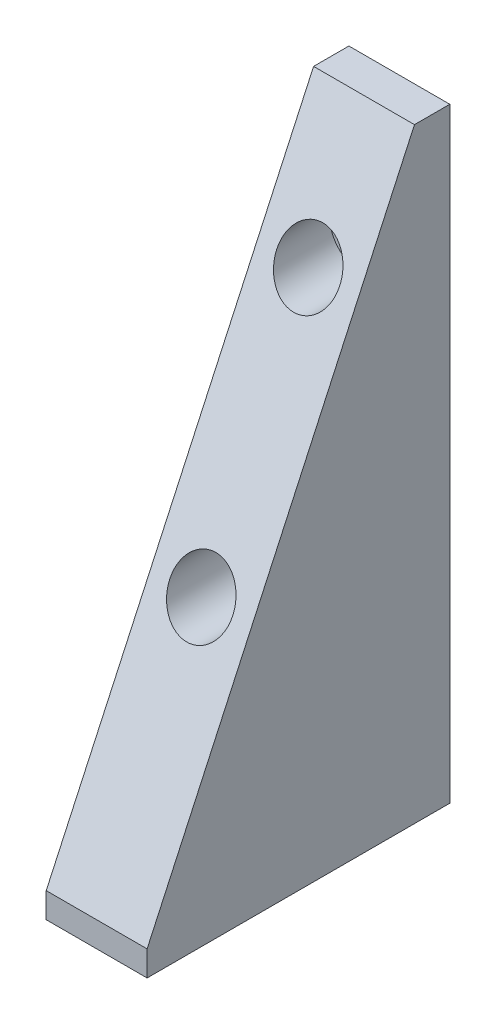
ISO-10303-21;
HEADER;
FILE_DESCRIPTION(('STEP AP214'),'2;1');
FILE_NAME('part.step','',(''),(''),'','','');
FILE_SCHEMA(('AUTOMOTIVE_DESIGN { 1 0 10303 214 1 1 1 1 }'));
ENDSEC;
DATA;
#1=APPLICATION_CONTEXT('core data for automotive mechanical design processes');
#2=APPLICATION_PROTOCOL_DEFINITION('international standard','automotive_design',2000,#1);
#3=PRODUCT_CONTEXT('',#1,'mechanical');
#4=PRODUCT('Part','Part','',(#3));
#5=PRODUCT_RELATED_PRODUCT_CATEGORY('part','',(#4));
#6=PRODUCT_DEFINITION_FORMATION('','',#4);
#7=PRODUCT_DEFINITION_CONTEXT('part definition',#1,'design');
#8=PRODUCT_DEFINITION('design','',#6,#7);
#9=PRODUCT_DEFINITION_SHAPE('','',#8);
#10=(LENGTH_UNIT() NAMED_UNIT(*) SI_UNIT(.MILLI.,.METRE.));
#11=(NAMED_UNIT(*) PLANE_ANGLE_UNIT() SI_UNIT($,.RADIAN.));
#12=(NAMED_UNIT(*) SI_UNIT($,.STERADIAN.) SOLID_ANGLE_UNIT());
#13=UNCERTAINTY_MEASURE_WITH_UNIT(LENGTH_MEASURE(1.E-05),#10,'distance_accuracy_value','');
#14=(GEOMETRIC_REPRESENTATION_CONTEXT(3) GLOBAL_UNCERTAINTY_ASSIGNED_CONTEXT((#13)) GLOBAL_UNIT_ASSIGNED_CONTEXT((#10,
#11,#12)) REPRESENTATION_CONTEXT('',''));
#15=CARTESIAN_POINT('',(0.,0.,0.));
#16=DIRECTION('',(0.,0.,1.));
#17=DIRECTION('',(1.,0.,0.));
#18=AXIS2_PLACEMENT_3D('',#15,#16,#17);
#19=CARTESIAN_POINT('',(25.4,-25.781,-30.4159761721431));
#20=DIRECTION('',(0.,0.,1.));
#21=DIRECTION('',(1.,0.,0.));
#22=AXIS2_PLACEMENT_3D('',#19,#20,#21);
#23=PLANE('',#22);
#24=CARTESIAN_POINT('',(12.7,37.719,-30.4159761721431));
#25=DIRECTION('',(0.,0.,1.));
#26=DIRECTION('',(1.,0.,0.));
#27=AXIS2_PLACEMENT_3D('',#24,#25,#26);
#28=CIRCLE('',#27,4.9022);
#29=CARTESIAN_POINT('',(17.6022,37.719,-30.4159761721431));
#30=VERTEX_POINT('',#29);
#31=EDGE_CURVE('E153',#30,#30,#28,.T.);
#32=ORIENTED_EDGE('',*,*,#31,.T.);
#33=EDGE_LOOP('',(#32));
#34=FACE_BOUND('',#33,.T.);
#35=CARTESIAN_POINT('',(12.7,96.139,-30.4159761721431));
#36=DIRECTION('',(0.,0.,1.));
#37=DIRECTION('',(1.,0.,0.));
#38=AXIS2_PLACEMENT_3D('',#35,#36,#37);
#39=CIRCLE('',#38,4.9022);
#40=CARTESIAN_POINT('',(17.6022,96.139,-30.4159761721431));
#41=VERTEX_POINT('',#40);
#42=EDGE_CURVE('E118',#41,#41,#39,.T.);
#43=ORIENTED_EDGE('',*,*,#42,.T.);
#44=EDGE_LOOP('',(#43));
#45=FACE_BOUND('',#44,.T.);
#46=DIRECTION('',(0.,1.,0.));
#47=VECTOR('',#46,1.);
#48=CARTESIAN_POINT('',(0.,-25.781,-30.4159761721431));
#49=LINE('',#48,#47);
#50=CARTESIAN_POINT('',(0.,-25.781,-30.4159761721431));
#51=VERTEX_POINT('',#50);
#52=CARTESIAN_POINT('',(0.,126.619,-30.4159761721431));
#53=VERTEX_POINT('',#52);
#54=EDGE_CURVE('E114',#51,#53,#49,.T.);
#55=ORIENTED_EDGE('',*,*,#54,.T.);
#56=DIRECTION('',(-1.,0.,0.));
#57=VECTOR('',#56,1.);
#58=CARTESIAN_POINT('',(25.4,126.619,-30.4159761721431));
#59=LINE('',#58,#57);
#60=CARTESIAN_POINT('',(25.4,126.619,-30.4159761721431));
#61=VERTEX_POINT('',#60);
#62=EDGE_CURVE('E11',#61,#53,#59,.T.);
#63=ORIENTED_EDGE('',*,*,#62,.F.);
#64=DIRECTION('',(0.,1.,0.));
#65=VECTOR('',#64,1.);
#66=CARTESIAN_POINT('',(25.4,-25.781,-30.4159761721431));
#67=LINE('',#66,#65);
#68=CARTESIAN_POINT('',(25.4,-25.781,-30.4159761721431));
#69=VERTEX_POINT('',#68);
#70=EDGE_CURVE('E123',#69,#61,#67,.T.);
#71=ORIENTED_EDGE('',*,*,#70,.F.);
#72=DIRECTION('',(-1.,0.,0.));
#73=VECTOR('',#72,1.);
#74=CARTESIAN_POINT('',(25.4,-25.781,-30.4159761721431));
#75=LINE('',#74,#73);
#76=EDGE_CURVE('E110',#69,#51,#75,.T.);
#77=ORIENTED_EDGE('',*,*,#76,.T.);
#78=EDGE_LOOP('',(#55,#63,#71,#77));
#79=FACE_BOUND('',#78,.T.);
#80=ADVANCED_FACE('F37',(#34,#45,#79),#23,.F.);
#81=CARTESIAN_POINT('',(25.4,126.619,-21.5259761721431));
#82=DIRECTION('',(0.,-1.,0.));
#83=DIRECTION('',(0.,0.,-1.));
#84=AXIS2_PLACEMENT_3D('',#81,#82,#83);
#85=PLANE('',#84);
#86=DIRECTION('',(0.,0.,1.));
#87=VECTOR('',#86,1.);
#88=CARTESIAN_POINT('',(0.,126.619,-21.5259761721431));
#89=LINE('',#88,#87);
#90=CARTESIAN_POINT('',(0.,126.619,-21.5259761721431));
#91=VERTEX_POINT('',#90);
#92=EDGE_CURVE('E117',#53,#91,#89,.T.);
#93=ORIENTED_EDGE('',*,*,#92,.T.);
#94=DIRECTION('',(-1.,0.,0.));
#95=VECTOR('',#94,1.);
#96=CARTESIAN_POINT('',(25.4,126.619,-21.5259761721431));
#97=LINE('',#96,#95);
#98=CARTESIAN_POINT('',(25.4,126.619,-21.5259761721431));
#99=VERTEX_POINT('',#98);
#100=EDGE_CURVE('E45',#99,#91,#97,.T.);
#101=ORIENTED_EDGE('',*,*,#100,.F.);
#102=DIRECTION('',(0.,0.,1.));
#103=VECTOR('',#102,1.);
#104=CARTESIAN_POINT('',(25.4,126.619,-21.5259761721431));
#105=LINE('',#104,#103);
#106=EDGE_CURVE('E88',#61,#99,#105,.T.);
#107=ORIENTED_EDGE('',*,*,#106,.F.);
#108=ORIENTED_EDGE('',*,*,#62,.T.);
#109=EDGE_LOOP('',(#93,#101,#107,#108));
#110=FACE_BOUND('',#109,.T.);
#111=ADVANCED_FACE('F145',(#110),#85,.F.);
#112=CARTESIAN_POINT('',(25.4,126.619,-21.5259761721431));
#113=DIRECTION('',(0.,-0.418557308836963,-0.90819038709907));
#114=DIRECTION('',(0.,0.90819038709907,-0.418557308836963));
#115=AXIS2_PLACEMENT_3D('',#112,#113,#114);
#116=PLANE('',#115);
#117=CARTESIAN_POINT('',(12.7,96.139,-7.47867182431704));
#118=DIRECTION('',(0.,-0.418557308836963,-0.90819038709907));
#119=DIRECTION('',(0.,0.90819038709907,-0.418557308836963));
#120=AXIS2_PLACEMENT_3D('',#117,#118,#119);
#121=ELLIPSE('',#120,8.739907526828,7.9375);
#122=CARTESIAN_POINT('',(12.7,104.0765,-11.1368239982301));
#123=VERTEX_POINT('',#122);
#124=EDGE_CURVE('E176',#123,#123,#121,.T.);
#125=ORIENTED_EDGE('',*,*,#124,.T.);
#126=EDGE_LOOP('',(#125));
#127=FACE_BOUND('',#126,.T.);
#128=CARTESIAN_POINT('',(12.7,37.719,19.445328175683));
#129=DIRECTION('',(0.,-0.418557308836963,-0.90819038709907));
#130=DIRECTION('',(0.,0.90819038709907,-0.418557308836963));
#131=AXIS2_PLACEMENT_3D('',#128,#129,#130);
#132=ELLIPSE('',#131,8.739907526828,7.9375);
#133=CARTESIAN_POINT('',(12.7,45.6565,15.7871760017699));
#134=VERTEX_POINT('',#133);
#135=EDGE_CURVE('E173',#134,#134,#132,.T.);
#136=ORIENTED_EDGE('',*,*,#135,.T.);
#137=EDGE_LOOP('',(#136));
#138=FACE_BOUND('',#137,.T.);
#139=DIRECTION('',(0.,-0.90819038709907,0.418557308836963));
#140=VECTOR('',#139,1.);
#141=CARTESIAN_POINT('',(0.,126.619,-21.5259761721431));
#142=LINE('',#141,#140);
#143=CARTESIAN_POINT('',(0.,-19.431,45.7840238278569));
#144=VERTEX_POINT('',#143);
#145=EDGE_CURVE('E105',#91,#144,#142,.T.);
#146=ORIENTED_EDGE('',*,*,#145,.T.);
#147=DIRECTION('',(-1.,0.,0.));
#148=VECTOR('',#147,1.);
#149=CARTESIAN_POINT('',(25.4,-19.431,45.7840238278569));
#150=LINE('',#149,#148);
#151=CARTESIAN_POINT('',(25.4,-19.431,45.7840238278569));
#152=VERTEX_POINT('',#151);
#153=EDGE_CURVE('E102',#152,#144,#150,.T.);
#154=ORIENTED_EDGE('',*,*,#153,.F.);
#155=DIRECTION('',(0.,-0.90819038709907,0.418557308836963));
#156=VECTOR('',#155,1.);
#157=CARTESIAN_POINT('',(25.4,126.619,-21.5259761721431));
#158=LINE('',#157,#156);
#159=EDGE_CURVE('E94',#99,#152,#158,.T.);
#160=ORIENTED_EDGE('',*,*,#159,.F.);
#161=ORIENTED_EDGE('',*,*,#100,.T.);
#162=EDGE_LOOP('',(#146,#154,#160,#161));
#163=FACE_BOUND('',#162,.T.);
#164=ADVANCED_FACE('F103',(#127,#138,#163),#116,.F.);
#165=CARTESIAN_POINT('',(25.4,-19.431,45.7840238278569));
#166=DIRECTION('',(0.,0.,-1.));
#167=DIRECTION('',(-1.,0.,0.));
#168=AXIS2_PLACEMENT_3D('',#165,#166,#167);
#169=PLANE('',#168);
#170=DIRECTION('',(0.,-1.,0.));
#171=VECTOR('',#170,1.);
#172=CARTESIAN_POINT('',(0.,-19.431,45.7840238278569));
#173=LINE('',#172,#171);
#174=CARTESIAN_POINT('',(0.,-25.781,45.7840238278569));
#175=VERTEX_POINT('',#174);
#176=EDGE_CURVE('E74',#144,#175,#173,.T.);
#177=ORIENTED_EDGE('',*,*,#176,.T.);
#178=DIRECTION('',(-1.,0.,0.));
#179=VECTOR('',#178,1.);
#180=CARTESIAN_POINT('',(25.4,-25.781,45.7840238278569));
#181=LINE('',#180,#179);
#182=CARTESIAN_POINT('',(25.4,-25.781,45.7840238278569));
#183=VERTEX_POINT('',#182);
#184=EDGE_CURVE('E106',#183,#175,#181,.T.);
#185=ORIENTED_EDGE('',*,*,#184,.F.);
#186=DIRECTION('',(0.,-1.,0.));
#187=VECTOR('',#186,1.);
#188=CARTESIAN_POINT('',(25.4,-19.431,45.7840238278569));
#189=LINE('',#188,#187);
#190=EDGE_CURVE('E98',#152,#183,#189,.T.);
#191=ORIENTED_EDGE('',*,*,#190,.F.);
#192=ORIENTED_EDGE('',*,*,#153,.T.);
#193=EDGE_LOOP('',(#177,#185,#191,#192));
#194=FACE_BOUND('',#193,.T.);
#195=ADVANCED_FACE('F108',(#194),#169,.F.);
#196=CARTESIAN_POINT('',(25.4,-25.781,45.7840238278569));
#197=DIRECTION('',(0.,1.,0.));
#198=DIRECTION('',(0.,0.,1.));
#199=AXIS2_PLACEMENT_3D('',#196,#197,#198);
#200=PLANE('',#199);
#201=CARTESIAN_POINT('',(12.7,-25.781,-15.1759761721431));
#202=DIRECTION('',(0.,-1.,0.));
#203=DIRECTION('',(0.,0.,-1.));
#204=AXIS2_PLACEMENT_3D('',#201,#202,#203);
#205=CIRCLE('',#204,3.96875);
#206=CARTESIAN_POINT('',(12.7,-25.781,-19.1447261721431));
#207=VERTEX_POINT('',#206);
#208=EDGE_CURVE('E188',#207,#207,#205,.T.);
#209=ORIENTED_EDGE('',*,*,#208,.F.);
#210=EDGE_LOOP('',(#209));
#211=FACE_BOUND('',#210,.T.);
#212=CARTESIAN_POINT('',(12.7,-25.781,25.4640238278569));
#213=DIRECTION('',(0.,-1.,0.));
#214=DIRECTION('',(0.,0.,-1.));
#215=AXIS2_PLACEMENT_3D('',#212,#213,#214);
#216=CIRCLE('',#215,3.96875);
#217=CARTESIAN_POINT('',(12.7,-25.781,21.4952738278569));
#218=VERTEX_POINT('',#217);
#219=EDGE_CURVE('E182',#218,#218,#216,.T.);
#220=ORIENTED_EDGE('',*,*,#219,.F.);
#221=EDGE_LOOP('',(#220));
#222=FACE_BOUND('',#221,.T.);
#223=DIRECTION('',(0.,0.,-1.));
#224=VECTOR('',#223,1.);
#225=CARTESIAN_POINT('',(0.,-25.781,45.7840238278569));
#226=LINE('',#225,#224);
#227=EDGE_CURVE('E80',#175,#51,#226,.T.);
#228=ORIENTED_EDGE('',*,*,#227,.T.);
#229=ORIENTED_EDGE('',*,*,#76,.F.);
#230=DIRECTION('',(0.,0.,-1.));
#231=VECTOR('',#230,1.);
#232=CARTESIAN_POINT('',(25.4,-25.781,45.7840238278569));
#233=LINE('',#232,#231);
#234=EDGE_CURVE('E53',#183,#69,#233,.T.);
#235=ORIENTED_EDGE('',*,*,#234,.F.);
#236=ORIENTED_EDGE('',*,*,#184,.T.);
#237=EDGE_LOOP('',(#228,#229,#235,#236));
#238=FACE_BOUND('',#237,.T.);
#239=ADVANCED_FACE('F131',(#211,#222,#238),#200,.F.);
#240=CARTESIAN_POINT('',(25.4,0.,0.));
#241=DIRECTION('',(-1.,0.,0.));
#242=DIRECTION('',(0.,0.,1.));
#243=AXIS2_PLACEMENT_3D('',#240,#241,#242);
#244=PLANE('',#243);
#245=ORIENTED_EDGE('',*,*,#70,.T.);
#246=ORIENTED_EDGE('',*,*,#106,.T.);
#247=ORIENTED_EDGE('',*,*,#159,.T.);
#248=ORIENTED_EDGE('',*,*,#190,.T.);
#249=ORIENTED_EDGE('',*,*,#234,.T.);
#250=EDGE_LOOP('',(#245,#246,#247,#248,#249));
#251=FACE_BOUND('',#250,.T.);
#252=ADVANCED_FACE('F96',(#251),#244,.F.);
#253=CARTESIAN_POINT('',(0.,0.,0.));
#254=DIRECTION('',(-1.,0.,0.));
#255=DIRECTION('',(0.,0.,1.));
#256=AXIS2_PLACEMENT_3D('',#253,#254,#255);
#257=PLANE('',#256);
#258=ORIENTED_EDGE('',*,*,#54,.F.);
#259=ORIENTED_EDGE('',*,*,#227,.F.);
#260=ORIENTED_EDGE('',*,*,#176,.F.);
#261=ORIENTED_EDGE('',*,*,#145,.F.);
#262=ORIENTED_EDGE('',*,*,#92,.F.);
#263=EDGE_LOOP('',(#258,#259,#260,#261,#262));
#264=FACE_BOUND('',#263,.T.);
#265=ADVANCED_FACE('F127',(#264),#257,.T.);
#266=CARTESIAN_POINT('',(12.7,96.139,-11.3659761721431));
#267=DIRECTION('',(0.,0.,1.));
#268=DIRECTION('',(1.,0.,0.));
#269=AXIS2_PLACEMENT_3D('',#266,#267,#268);
#270=CYLINDRICAL_SURFACE('',#269,4.9022);
#271=ORIENTED_EDGE('',*,*,#42,.F.);
#272=EDGE_LOOP('',(#271));
#273=FACE_BOUND('',#272,.T.);
#274=CARTESIAN_POINT('',(12.7,96.139,-20.8909761721431));
#275=DIRECTION('',(0.,0.,1.));
#276=DIRECTION('',(1.,0.,0.));
#277=AXIS2_PLACEMENT_3D('',#274,#275,#276);
#278=CIRCLE('',#277,4.9022);
#279=CARTESIAN_POINT('',(17.6022,96.139,-20.8909761721431));
#280=VERTEX_POINT('',#279);
#281=EDGE_CURVE('E157',#280,#280,#278,.T.);
#282=ORIENTED_EDGE('',*,*,#281,.T.);
#283=EDGE_LOOP('',(#282));
#284=FACE_BOUND('',#283,.T.);
#285=ADVANCED_FACE('F230',(#273,#284),#270,.F.);
#286=CARTESIAN_POINT('',(17.6022,96.139,-20.8909761721431));
#287=DIRECTION('',(0.,0.,-1.));
#288=DIRECTION('',(-1.,0.,0.));
#289=AXIS2_PLACEMENT_3D('',#286,#287,#288);
#290=PLANE('',#289);
#291=ORIENTED_EDGE('',*,*,#281,.F.);
#292=EDGE_LOOP('',(#291));
#293=FACE_BOUND('',#292,.T.);
#294=CARTESIAN_POINT('',(12.7,96.139,-20.8909761721431));
#295=DIRECTION('',(0.,0.,1.));
#296=DIRECTION('',(1.,0.,0.));
#297=AXIS2_PLACEMENT_3D('',#294,#295,#296);
#298=CIRCLE('',#297,7.9375);
#299=CARTESIAN_POINT('',(20.6375,96.139,-20.8909761721431));
#300=VERTEX_POINT('',#299);
#301=EDGE_CURVE('E160',#300,#300,#298,.T.);
#302=ORIENTED_EDGE('',*,*,#301,.T.);
#303=EDGE_LOOP('',(#302));
#304=FACE_BOUND('',#303,.T.);
#305=ADVANCED_FACE('F226',(#293,#304),#290,.F.);
#306=CARTESIAN_POINT('',(12.7,96.139,-11.3659761721431));
#307=DIRECTION('',(0.,0.,1.));
#308=DIRECTION('',(1.,0.,0.));
#309=AXIS2_PLACEMENT_3D('',#306,#307,#308);
#310=CYLINDRICAL_SURFACE('',#309,7.9375);
#311=ORIENTED_EDGE('',*,*,#301,.F.);
#312=EDGE_LOOP('',(#311));
#313=FACE_BOUND('',#312,.T.);
#314=ORIENTED_EDGE('',*,*,#124,.F.);
#315=EDGE_LOOP('',(#314));
#316=FACE_BOUND('',#315,.T.);
#317=ADVANCED_FACE('F222',(#313,#316),#310,.F.);
#318=CARTESIAN_POINT('',(12.7,37.719,-10.0959761721431));
#319=DIRECTION('',(0.,0.,1.));
#320=DIRECTION('',(1.,0.,0.));
#321=AXIS2_PLACEMENT_3D('',#318,#319,#320);
#322=CYLINDRICAL_SURFACE('',#321,4.9022);
#323=ORIENTED_EDGE('',*,*,#31,.F.);
#324=EDGE_LOOP('',(#323));
#325=FACE_BOUND('',#324,.T.);
#326=CARTESIAN_POINT('',(12.7,37.719,-19.6209761721431));
#327=DIRECTION('',(0.,0.,1.));
#328=DIRECTION('',(1.,0.,0.));
#329=AXIS2_PLACEMENT_3D('',#326,#327,#328);
#330=CIRCLE('',#329,4.9022);
#331=CARTESIAN_POINT('',(17.6022,37.719,-19.6209761721431));
#332=VERTEX_POINT('',#331);
#333=EDGE_CURVE('E167',#332,#332,#330,.T.);
#334=ORIENTED_EDGE('',*,*,#333,.T.);
#335=EDGE_LOOP('',(#334));
#336=FACE_BOUND('',#335,.T.);
#337=ADVANCED_FACE('F218',(#325,#336),#322,.F.);
#338=CARTESIAN_POINT('',(17.6022,37.719,-19.6209761721431));
#339=DIRECTION('',(0.,0.,-1.));
#340=DIRECTION('',(-1.,0.,0.));
#341=AXIS2_PLACEMENT_3D('',#338,#339,#340);
#342=PLANE('',#341);
#343=ORIENTED_EDGE('',*,*,#333,.F.);
#344=EDGE_LOOP('',(#343));
#345=FACE_BOUND('',#344,.T.);
#346=CARTESIAN_POINT('',(12.7,37.719,-19.6209761721431));
#347=DIRECTION('',(0.,0.,1.));
#348=DIRECTION('',(1.,0.,0.));
#349=AXIS2_PLACEMENT_3D('',#346,#347,#348);
#350=CIRCLE('',#349,7.9375);
#351=CARTESIAN_POINT('',(20.6375,37.719,-19.6209761721431));
#352=VERTEX_POINT('',#351);
#353=EDGE_CURVE('E170',#352,#352,#350,.T.);
#354=ORIENTED_EDGE('',*,*,#353,.T.);
#355=EDGE_LOOP('',(#354));
#356=FACE_BOUND('',#355,.T.);
#357=ADVANCED_FACE('F214',(#345,#356),#342,.F.);
#358=CARTESIAN_POINT('',(12.7,37.719,-10.0959761721431));
#359=DIRECTION('',(0.,0.,1.));
#360=DIRECTION('',(1.,0.,0.));
#361=AXIS2_PLACEMENT_3D('',#358,#359,#360);
#362=CYLINDRICAL_SURFACE('',#361,7.9375);
#363=ORIENTED_EDGE('',*,*,#353,.F.);
#364=EDGE_LOOP('',(#363));
#365=FACE_BOUND('',#364,.T.);
#366=ORIENTED_EDGE('',*,*,#135,.F.);
#367=EDGE_LOOP('',(#366));
#368=FACE_BOUND('',#367,.T.);
#369=ADVANCED_FACE('F210',(#365,#368),#362,.F.);
#370=CARTESIAN_POINT('',(12.7,-0.38100000000001,25.4640238278569));
#371=DIRECTION('',(0.,-1.,0.));
#372=DIRECTION('',(0.,0.,-1.));
#373=AXIS2_PLACEMENT_3D('',#370,#371,#372);
#374=CONICAL_SURFACE('',#373,3.96875,1.02974425867665);
#375=CARTESIAN_POINT('',(12.7,2.00366558176562,25.4640238278569));
#376=VERTEX_POINT('',#375);
#377=VERTEX_LOOP('',#376);
#378=FACE_BOUND('',#377,.T.);
#379=CARTESIAN_POINT('',(12.7,-0.38100000000001,25.4640238278569));
#380=DIRECTION('',(0.,-1.,0.));
#381=DIRECTION('',(0.,0.,-1.));
#382=AXIS2_PLACEMENT_3D('',#379,#380,#381);
#383=CIRCLE('',#382,3.96875);
#384=CARTESIAN_POINT('',(12.7,-0.38100000000001,21.4952738278569));
#385=VERTEX_POINT('',#384);
#386=EDGE_CURVE('E179',#385,#385,#383,.T.);
#387=ORIENTED_EDGE('',*,*,#386,.T.);
#388=EDGE_LOOP('',(#387));
#389=FACE_BOUND('',#388,.T.);
#390=ADVANCED_FACE('F206',(#378,#389),#374,.F.);
#391=CARTESIAN_POINT('',(12.7,-25.781,25.4640238278569));
#392=DIRECTION('',(0.,-1.,0.));
#393=DIRECTION('',(0.,0.,-1.));
#394=AXIS2_PLACEMENT_3D('',#391,#392,#393);
#395=CYLINDRICAL_SURFACE('',#394,3.96875);
#396=ORIENTED_EDGE('',*,*,#386,.F.);
#397=EDGE_LOOP('',(#396));
#398=FACE_BOUND('',#397,.T.);
#399=ORIENTED_EDGE('',*,*,#219,.T.);
#400=EDGE_LOOP('',(#399));
#401=FACE_BOUND('',#400,.T.);
#402=ADVANCED_FACE('F199',(#398,#401),#395,.F.);
#403=CARTESIAN_POINT('',(12.7,-0.38100000000001,-15.1759761721431));
#404=DIRECTION('',(0.,-1.,0.));
#405=DIRECTION('',(0.,0.,-1.));
#406=AXIS2_PLACEMENT_3D('',#403,#404,#405);
#407=CONICAL_SURFACE('',#406,3.96875,1.02974425867665);
#408=CARTESIAN_POINT('',(12.7,2.00366558176562,-15.1759761721431));
#409=VERTEX_POINT('',#408);
#410=VERTEX_LOOP('',#409);
#411=FACE_BOUND('',#410,.T.);
#412=CARTESIAN_POINT('',(12.7,-0.38100000000001,-15.1759761721431));
#413=DIRECTION('',(0.,-1.,0.));
#414=DIRECTION('',(0.,0.,-1.));
#415=AXIS2_PLACEMENT_3D('',#412,#413,#414);
#416=CIRCLE('',#415,3.96875);
#417=CARTESIAN_POINT('',(12.7,-0.38100000000001,-19.1447261721431));
#418=VERTEX_POINT('',#417);
#419=EDGE_CURVE('E185',#418,#418,#416,.T.);
#420=ORIENTED_EDGE('',*,*,#419,.T.);
#421=EDGE_LOOP('',(#420));
#422=FACE_BOUND('',#421,.T.);
#423=ADVANCED_FACE('F193',(#411,#422),#407,.F.);
#424=CARTESIAN_POINT('',(12.7,-25.781,-15.1759761721431));
#425=DIRECTION('',(0.,-1.,0.));
#426=DIRECTION('',(0.,0.,-1.));
#427=AXIS2_PLACEMENT_3D('',#424,#425,#426);
#428=CYLINDRICAL_SURFACE('',#427,3.96875);
#429=ORIENTED_EDGE('',*,*,#419,.F.);
#430=EDGE_LOOP('',(#429));
#431=FACE_BOUND('',#430,.T.);
#432=ORIENTED_EDGE('',*,*,#208,.T.);
#433=EDGE_LOOP('',(#432));
#434=FACE_BOUND('',#433,.T.);
#435=ADVANCED_FACE('F191',(#431,#434),#428,.F.);
#436=CLOSED_SHELL('',(#80,#111,#164,#195,#239,#252,#265,#285,#305,#317,#337,#357,#369,#390,#402,
#423,#435));
#437=MANIFOLD_SOLID_BREP('B2',#436);
#438=ADVANCED_BREP_SHAPE_REPRESENTATION('',(#18,#437),#14);
#439=SHAPE_DEFINITION_REPRESENTATION(#9,#438);
ENDSEC;
END-ISO-10303-21;
